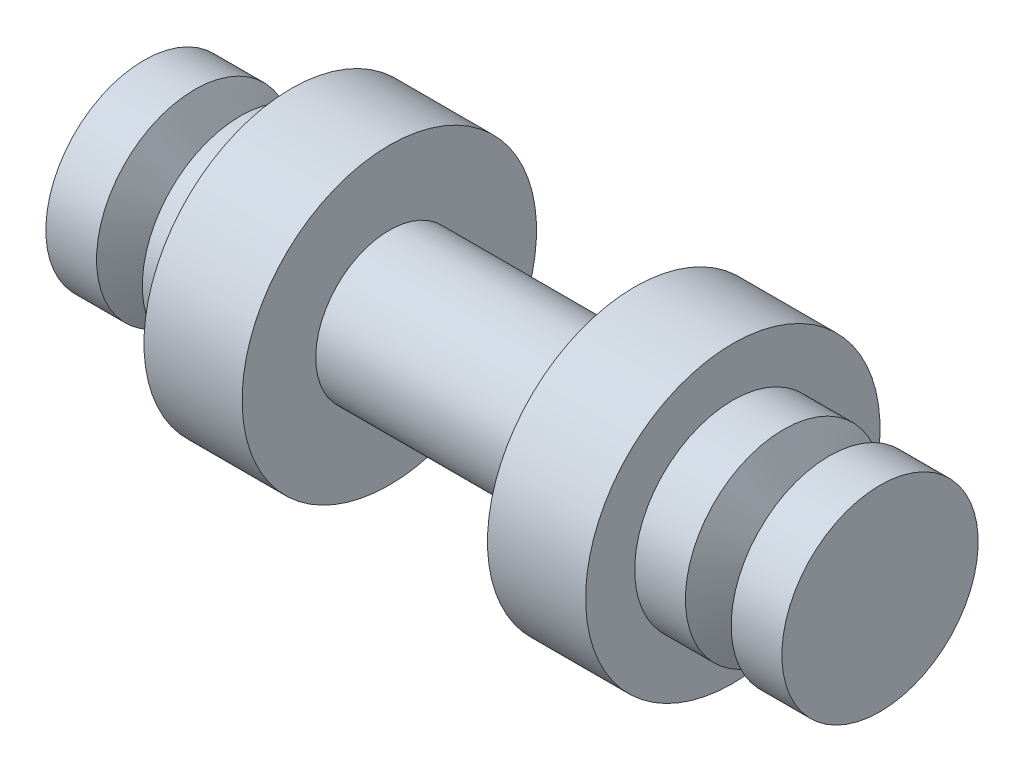
ISO-10303-21;
HEADER;
FILE_DESCRIPTION(('STEP AP214'),'2;1');
FILE_NAME('part.step','',(''),(''),'','','');
FILE_SCHEMA(('AUTOMOTIVE_DESIGN { 1 0 10303 214 1 1 1 1 }'));
ENDSEC;
DATA;
#1=APPLICATION_CONTEXT('core data for automotive mechanical design processes');
#2=APPLICATION_PROTOCOL_DEFINITION('international standard','automotive_design',2000,#1);
#3=PRODUCT_CONTEXT('',#1,'mechanical');
#4=PRODUCT('Part','Part','',(#3));
#5=PRODUCT_RELATED_PRODUCT_CATEGORY('part','',(#4));
#6=PRODUCT_DEFINITION_FORMATION('','',#4);
#7=PRODUCT_DEFINITION_CONTEXT('part definition',#1,'design');
#8=PRODUCT_DEFINITION('design','',#6,#7);
#9=PRODUCT_DEFINITION_SHAPE('','',#8);
#10=(LENGTH_UNIT() NAMED_UNIT(*) SI_UNIT(.MILLI.,.METRE.));
#11=(NAMED_UNIT(*) PLANE_ANGLE_UNIT() SI_UNIT($,.RADIAN.));
#12=(NAMED_UNIT(*) SI_UNIT($,.STERADIAN.) SOLID_ANGLE_UNIT());
#13=UNCERTAINTY_MEASURE_WITH_UNIT(LENGTH_MEASURE(1.E-05),#10,'distance_accuracy_value','');
#14=(GEOMETRIC_REPRESENTATION_CONTEXT(3) GLOBAL_UNCERTAINTY_ASSIGNED_CONTEXT((#13)) GLOBAL_UNIT_ASSIGNED_CONTEXT((#10,
#11,#12)) REPRESENTATION_CONTEXT('',''));
#15=CARTESIAN_POINT('',(0.,0.,0.));
#16=DIRECTION('',(0.,0.,1.));
#17=DIRECTION('',(1.,0.,0.));
#18=AXIS2_PLACEMENT_3D('',#15,#16,#17);
#19=CARTESIAN_POINT('',(-75.,0.,0.));
#20=DIRECTION('',(-1.,0.,0.));
#21=DIRECTION('',(0.,-1.,0.));
#22=AXIS2_PLACEMENT_3D('',#19,#20,#21);
#23=CYLINDRICAL_SURFACE('',#22,20.);
#24=CARTESIAN_POINT('',(-75.,0.,0.));
#25=DIRECTION('',(-1.,0.,0.));
#26=DIRECTION('',(0.,-1.,0.));
#27=AXIS2_PLACEMENT_3D('',#24,#25,#26);
#28=CIRCLE('',#27,20.);
#29=CARTESIAN_POINT('',(-75.,-20.,0.));
#30=VERTEX_POINT('',#29);
#31=EDGE_CURVE('E10',#30,#30,#28,.T.);
#32=ORIENTED_EDGE('',*,*,#31,.F.);
#33=EDGE_LOOP('',(#32));
#34=FACE_BOUND('',#33,.T.);
#35=CARTESIAN_POINT('',(-64.6630765815499,0.,0.));
#36=DIRECTION('',(-1.,0.,0.));
#37=DIRECTION('',(0.,-1.,0.));
#38=AXIS2_PLACEMENT_3D('',#35,#36,#37);
#39=CIRCLE('',#38,20.);
#40=CARTESIAN_POINT('',(-64.6630765815499,-20.,0.));
#41=VERTEX_POINT('',#40);
#42=EDGE_CURVE('E83',#41,#41,#39,.T.);
#43=ORIENTED_EDGE('',*,*,#42,.T.);
#44=EDGE_LOOP('',(#43));
#45=FACE_BOUND('',#44,.T.);
#46=ADVANCED_FACE('F31',(#34,#45),#23,.T.);
#47=CARTESIAN_POINT('',(-75.,20.,0.));
#48=DIRECTION('',(1.,0.,0.));
#49=DIRECTION('',(0.,1.,0.));
#50=AXIS2_PLACEMENT_3D('',#47,#48,#49);
#51=PLANE('',#50);
#52=ORIENTED_EDGE('',*,*,#31,.T.);
#53=EDGE_LOOP('',(#52));
#54=FACE_BOUND('',#53,.T.);
#55=ADVANCED_FACE('F173',(#54),#51,.F.);
#56=CARTESIAN_POINT('',(75.,20.,0.));
#57=DIRECTION('',(-1.,0.,0.));
#58=DIRECTION('',(0.,-1.,0.));
#59=AXIS2_PLACEMENT_3D('',#56,#57,#58);
#60=PLANE('',#59);
#61=CARTESIAN_POINT('',(75.,0.,0.));
#62=DIRECTION('',(-1.,0.,0.));
#63=DIRECTION('',(0.,-1.,0.));
#64=AXIS2_PLACEMENT_3D('',#61,#62,#63);
#65=CIRCLE('',#64,20.);
#66=CARTESIAN_POINT('',(75.,-20.,0.));
#67=VERTEX_POINT('',#66);
#68=EDGE_CURVE('E37',#67,#67,#65,.T.);
#69=ORIENTED_EDGE('',*,*,#68,.F.);
#70=EDGE_LOOP('',(#69));
#71=FACE_BOUND('',#70,.T.);
#72=ADVANCED_FACE('F168',(#71),#60,.F.);
#73=CARTESIAN_POINT('',(-75.,0.,0.));
#74=DIRECTION('',(-1.,0.,0.));
#75=DIRECTION('',(0.,-1.,0.));
#76=AXIS2_PLACEMENT_3D('',#73,#74,#75);
#77=CYLINDRICAL_SURFACE('',#76,20.);
#78=CARTESIAN_POINT('',(64.6630765815499,0.,0.));
#79=DIRECTION('',(-1.,0.,0.));
#80=DIRECTION('',(0.,-1.,0.));
#81=AXIS2_PLACEMENT_3D('',#78,#79,#80);
#82=CIRCLE('',#81,20.);
#83=CARTESIAN_POINT('',(64.6630765815499,-20.,0.));
#84=VERTEX_POINT('',#83);
#85=EDGE_CURVE('E41',#84,#84,#82,.T.);
#86=ORIENTED_EDGE('',*,*,#85,.F.);
#87=EDGE_LOOP('',(#86));
#88=FACE_BOUND('',#87,.T.);
#89=ORIENTED_EDGE('',*,*,#68,.T.);
#90=EDGE_LOOP('',(#89));
#91=FACE_BOUND('',#90,.T.);
#92=ADVANCED_FACE('F163',(#88,#91),#77,.T.);
#93=CARTESIAN_POINT('',(64.6630765815499,0.,0.));
#94=DIRECTION('',(1.,0.,0.));
#95=DIRECTION('',(0.,1.,0.));
#96=AXIS2_PLACEMENT_3D('',#93,#94,#95);
#97=CONICAL_SURFACE('',#96,20.,1.13446401379632);
#98=CARTESIAN_POINT('',(60.,0.,0.));
#99=DIRECTION('',(-1.,0.,0.));
#100=DIRECTION('',(0.,-1.,0.));
#101=AXIS2_PLACEMENT_3D('',#98,#99,#100);
#102=CIRCLE('',#101,9.99999999999997);
#103=CARTESIAN_POINT('',(60.,-9.99999999999995,0.));
#104=VERTEX_POINT('',#103);
#105=EDGE_CURVE('E45',#104,#104,#102,.T.);
#106=ORIENTED_EDGE('',*,*,#105,.F.);
#107=EDGE_LOOP('',(#106));
#108=FACE_BOUND('',#107,.T.);
#109=ORIENTED_EDGE('',*,*,#85,.T.);
#110=EDGE_LOOP('',(#109));
#111=FACE_BOUND('',#110,.T.);
#112=ADVANCED_FACE('F157',(#108,#111),#97,.T.);
#113=CARTESIAN_POINT('',(60.,0.,0.));
#114=DIRECTION('',(-1.,0.,0.));
#115=DIRECTION('',(0.,-1.,0.));
#116=AXIS2_PLACEMENT_3D('',#113,#114,#115);
#117=CONICAL_SURFACE('',#116,9.99999999999997,1.13446401379631);
#118=CARTESIAN_POINT('',(55.33692341845,0.,0.));
#119=DIRECTION('',(-1.,0.,0.));
#120=DIRECTION('',(0.,-1.,0.));
#121=AXIS2_PLACEMENT_3D('',#118,#119,#120);
#122=CIRCLE('',#121,20.);
#123=CARTESIAN_POINT('',(55.33692341845,-20.,0.));
#124=VERTEX_POINT('',#123);
#125=EDGE_CURVE('E50',#124,#124,#122,.T.);
#126=ORIENTED_EDGE('',*,*,#125,.F.);
#127=EDGE_LOOP('',(#126));
#128=FACE_BOUND('',#127,.T.);
#129=ORIENTED_EDGE('',*,*,#105,.T.);
#130=EDGE_LOOP('',(#129));
#131=FACE_BOUND('',#130,.T.);
#132=ADVANCED_FACE('F151',(#128,#131),#117,.T.);
#133=CARTESIAN_POINT('',(-75.,0.,0.));
#134=DIRECTION('',(-1.,0.,0.));
#135=DIRECTION('',(0.,-1.,0.));
#136=AXIS2_PLACEMENT_3D('',#133,#134,#135);
#137=CYLINDRICAL_SURFACE('',#136,20.);
#138=CARTESIAN_POINT('',(45.,0.,0.));
#139=DIRECTION('',(-1.,0.,0.));
#140=DIRECTION('',(0.,-1.,0.));
#141=AXIS2_PLACEMENT_3D('',#138,#139,#140);
#142=CIRCLE('',#141,20.);
#143=CARTESIAN_POINT('',(45.,-20.,0.));
#144=VERTEX_POINT('',#143);
#145=EDGE_CURVE('E53',#144,#144,#142,.T.);
#146=ORIENTED_EDGE('',*,*,#145,.F.);
#147=EDGE_LOOP('',(#146));
#148=FACE_BOUND('',#147,.T.);
#149=ORIENTED_EDGE('',*,*,#125,.T.);
#150=EDGE_LOOP('',(#149));
#151=FACE_BOUND('',#150,.T.);
#152=ADVANCED_FACE('F145',(#148,#151),#137,.T.);
#153=CARTESIAN_POINT('',(45.,30.,0.));
#154=DIRECTION('',(-1.,0.,0.));
#155=DIRECTION('',(0.,-1.,0.));
#156=AXIS2_PLACEMENT_3D('',#153,#154,#155);
#157=PLANE('',#156);
#158=CARTESIAN_POINT('',(45.,0.,0.));
#159=DIRECTION('',(-1.,0.,0.));
#160=DIRECTION('',(0.,-1.,0.));
#161=AXIS2_PLACEMENT_3D('',#158,#159,#160);
#162=CIRCLE('',#161,30.);
#163=CARTESIAN_POINT('',(45.,-30.,0.));
#164=VERTEX_POINT('',#163);
#165=EDGE_CURVE('E56',#164,#164,#162,.T.);
#166=ORIENTED_EDGE('',*,*,#165,.F.);
#167=EDGE_LOOP('',(#166));
#168=FACE_BOUND('',#167,.T.);
#169=ORIENTED_EDGE('',*,*,#145,.T.);
#170=EDGE_LOOP('',(#169));
#171=FACE_BOUND('',#170,.T.);
#172=ADVANCED_FACE('F139',(#168,#171),#157,.F.);
#173=CARTESIAN_POINT('',(-75.,0.,0.));
#174=DIRECTION('',(-1.,0.,0.));
#175=DIRECTION('',(0.,-1.,0.));
#176=AXIS2_PLACEMENT_3D('',#173,#174,#175);
#177=CYLINDRICAL_SURFACE('',#176,30.);
#178=CARTESIAN_POINT('',(25.,0.,0.));
#179=DIRECTION('',(-1.,0.,0.));
#180=DIRECTION('',(0.,-1.,0.));
#181=AXIS2_PLACEMENT_3D('',#178,#179,#180);
#182=CIRCLE('',#181,30.);
#183=CARTESIAN_POINT('',(25.,-30.,0.));
#184=VERTEX_POINT('',#183);
#185=EDGE_CURVE('E59',#184,#184,#182,.T.);
#186=ORIENTED_EDGE('',*,*,#185,.F.);
#187=EDGE_LOOP('',(#186));
#188=FACE_BOUND('',#187,.T.);
#189=ORIENTED_EDGE('',*,*,#165,.T.);
#190=EDGE_LOOP('',(#189));
#191=FACE_BOUND('',#190,.T.);
#192=ADVANCED_FACE('F133',(#188,#191),#177,.T.);
#193=CARTESIAN_POINT('',(25.,15.,0.));
#194=DIRECTION('',(1.,0.,0.));
#195=DIRECTION('',(0.,1.,0.));
#196=AXIS2_PLACEMENT_3D('',#193,#194,#195);
#197=PLANE('',#196);
#198=CARTESIAN_POINT('',(25.,0.,0.));
#199=DIRECTION('',(-1.,0.,0.));
#200=DIRECTION('',(0.,-1.,0.));
#201=AXIS2_PLACEMENT_3D('',#198,#199,#200);
#202=CIRCLE('',#201,15.);
#203=CARTESIAN_POINT('',(25.,-15.,0.));
#204=VERTEX_POINT('',#203);
#205=EDGE_CURVE('E62',#204,#204,#202,.T.);
#206=ORIENTED_EDGE('',*,*,#205,.F.);
#207=EDGE_LOOP('',(#206));
#208=FACE_BOUND('',#207,.T.);
#209=ORIENTED_EDGE('',*,*,#185,.T.);
#210=EDGE_LOOP('',(#209));
#211=FACE_BOUND('',#210,.T.);
#212=ADVANCED_FACE('F127',(#208,#211),#197,.F.);
#213=CARTESIAN_POINT('',(-75.,0.,0.));
#214=DIRECTION('',(-1.,0.,0.));
#215=DIRECTION('',(0.,-1.,0.));
#216=AXIS2_PLACEMENT_3D('',#213,#214,#215);
#217=CYLINDRICAL_SURFACE('',#216,15.);
#218=CARTESIAN_POINT('',(-25.,0.,0.));
#219=DIRECTION('',(-1.,0.,0.));
#220=DIRECTION('',(0.,-1.,0.));
#221=AXIS2_PLACEMENT_3D('',#218,#219,#220);
#222=CIRCLE('',#221,15.);
#223=CARTESIAN_POINT('',(-25.,-15.,0.));
#224=VERTEX_POINT('',#223);
#225=EDGE_CURVE('E65',#224,#224,#222,.T.);
#226=ORIENTED_EDGE('',*,*,#225,.F.);
#227=EDGE_LOOP('',(#226));
#228=FACE_BOUND('',#227,.T.);
#229=ORIENTED_EDGE('',*,*,#205,.T.);
#230=EDGE_LOOP('',(#229));
#231=FACE_BOUND('',#230,.T.);
#232=ADVANCED_FACE('F121',(#228,#231),#217,.T.);
#233=CARTESIAN_POINT('',(-25.,15.,0.));
#234=DIRECTION('',(-1.,0.,0.));
#235=DIRECTION('',(0.,-1.,0.));
#236=AXIS2_PLACEMENT_3D('',#233,#234,#235);
#237=PLANE('',#236);
#238=CARTESIAN_POINT('',(-25.,0.,0.));
#239=DIRECTION('',(-1.,0.,0.));
#240=DIRECTION('',(0.,-1.,0.));
#241=AXIS2_PLACEMENT_3D('',#238,#239,#240);
#242=CIRCLE('',#241,30.);
#243=CARTESIAN_POINT('',(-25.,-30.,0.));
#244=VERTEX_POINT('',#243);
#245=EDGE_CURVE('E68',#244,#244,#242,.T.);
#246=ORIENTED_EDGE('',*,*,#245,.F.);
#247=EDGE_LOOP('',(#246));
#248=FACE_BOUND('',#247,.T.);
#249=ORIENTED_EDGE('',*,*,#225,.T.);
#250=EDGE_LOOP('',(#249));
#251=FACE_BOUND('',#250,.T.);
#252=ADVANCED_FACE('F115',(#248,#251),#237,.F.);
#253=CARTESIAN_POINT('',(-75.,0.,0.));
#254=DIRECTION('',(-1.,0.,0.));
#255=DIRECTION('',(0.,-1.,0.));
#256=AXIS2_PLACEMENT_3D('',#253,#254,#255);
#257=CYLINDRICAL_SURFACE('',#256,30.);
#258=CARTESIAN_POINT('',(-45.,0.,0.));
#259=DIRECTION('',(-1.,0.,0.));
#260=DIRECTION('',(0.,-1.,0.));
#261=AXIS2_PLACEMENT_3D('',#258,#259,#260);
#262=CIRCLE('',#261,30.);
#263=CARTESIAN_POINT('',(-45.,-30.,0.));
#264=VERTEX_POINT('',#263);
#265=EDGE_CURVE('E71',#264,#264,#262,.T.);
#266=ORIENTED_EDGE('',*,*,#265,.F.);
#267=EDGE_LOOP('',(#266));
#268=FACE_BOUND('',#267,.T.);
#269=ORIENTED_EDGE('',*,*,#245,.T.);
#270=EDGE_LOOP('',(#269));
#271=FACE_BOUND('',#270,.T.);
#272=ADVANCED_FACE('F109',(#268,#271),#257,.T.);
#273=CARTESIAN_POINT('',(-45.,30.,0.));
#274=DIRECTION('',(1.,0.,0.));
#275=DIRECTION('',(0.,1.,0.));
#276=AXIS2_PLACEMENT_3D('',#273,#274,#275);
#277=PLANE('',#276);
#278=CARTESIAN_POINT('',(-45.,0.,0.));
#279=DIRECTION('',(-1.,0.,0.));
#280=DIRECTION('',(0.,-1.,0.));
#281=AXIS2_PLACEMENT_3D('',#278,#279,#280);
#282=CIRCLE('',#281,20.);
#283=CARTESIAN_POINT('',(-45.,-20.,0.));
#284=VERTEX_POINT('',#283);
#285=EDGE_CURVE('E74',#284,#284,#282,.T.);
#286=ORIENTED_EDGE('',*,*,#285,.F.);
#287=EDGE_LOOP('',(#286));
#288=FACE_BOUND('',#287,.T.);
#289=ORIENTED_EDGE('',*,*,#265,.T.);
#290=EDGE_LOOP('',(#289));
#291=FACE_BOUND('',#290,.T.);
#292=ADVANCED_FACE('F103',(#288,#291),#277,.F.);
#293=CARTESIAN_POINT('',(-75.,0.,0.));
#294=DIRECTION('',(-1.,0.,0.));
#295=DIRECTION('',(0.,-1.,0.));
#296=AXIS2_PLACEMENT_3D('',#293,#294,#295);
#297=CYLINDRICAL_SURFACE('',#296,20.);
#298=CARTESIAN_POINT('',(-55.33692341845,0.,0.));
#299=DIRECTION('',(-1.,0.,0.));
#300=DIRECTION('',(0.,-1.,0.));
#301=AXIS2_PLACEMENT_3D('',#298,#299,#300);
#302=CIRCLE('',#301,20.);
#303=CARTESIAN_POINT('',(-55.33692341845,-20.,0.));
#304=VERTEX_POINT('',#303);
#305=EDGE_CURVE('E77',#304,#304,#302,.T.);
#306=ORIENTED_EDGE('',*,*,#305,.F.);
#307=EDGE_LOOP('',(#306));
#308=FACE_BOUND('',#307,.T.);
#309=ORIENTED_EDGE('',*,*,#285,.T.);
#310=EDGE_LOOP('',(#309));
#311=FACE_BOUND('',#310,.T.);
#312=ADVANCED_FACE('F97',(#308,#311),#297,.T.);
#313=CARTESIAN_POINT('',(-55.33692341845,0.,0.));
#314=DIRECTION('',(1.,0.,0.));
#315=DIRECTION('',(0.,1.,0.));
#316=AXIS2_PLACEMENT_3D('',#313,#314,#315);
#317=CONICAL_SURFACE('',#316,20.,1.13446401379632);
#318=CARTESIAN_POINT('',(-60.,0.,0.));
#319=DIRECTION('',(-1.,0.,0.));
#320=DIRECTION('',(0.,-1.,0.));
#321=AXIS2_PLACEMENT_3D('',#318,#319,#320);
#322=CIRCLE('',#321,9.99999999999997);
#323=CARTESIAN_POINT('',(-60.,-9.99999999999997,0.));
#324=VERTEX_POINT('',#323);
#325=EDGE_CURVE('E80',#324,#324,#322,.T.);
#326=ORIENTED_EDGE('',*,*,#325,.F.);
#327=EDGE_LOOP('',(#326));
#328=FACE_BOUND('',#327,.T.);
#329=ORIENTED_EDGE('',*,*,#305,.T.);
#330=EDGE_LOOP('',(#329));
#331=FACE_BOUND('',#330,.T.);
#332=ADVANCED_FACE('F91',(#328,#331),#317,.T.);
#333=CARTESIAN_POINT('',(-60.,0.,0.));
#334=DIRECTION('',(-1.,0.,0.));
#335=DIRECTION('',(0.,-1.,0.));
#336=AXIS2_PLACEMENT_3D('',#333,#334,#335);
#337=CONICAL_SURFACE('',#336,9.99999999999997,1.13446401379632);
#338=ORIENTED_EDGE('',*,*,#42,.F.);
#339=EDGE_LOOP('',(#338));
#340=FACE_BOUND('',#339,.T.);
#341=ORIENTED_EDGE('',*,*,#325,.T.);
#342=EDGE_LOOP('',(#341));
#343=FACE_BOUND('',#342,.T.);
#344=ADVANCED_FACE('F88',(#340,#343),#337,.T.);
#345=CLOSED_SHELL('',(#46,#55,#72,#92,#112,#132,#152,#172,#192,#212,#232,#252,#272,#292,#312,
#332,#344));
#346=MANIFOLD_SOLID_BREP('B2',#345);
#347=ADVANCED_BREP_SHAPE_REPRESENTATION('',(#18,#346),#14);
#348=SHAPE_DEFINITION_REPRESENTATION(#9,#347);
ENDSEC;
END-ISO-10303-21;
